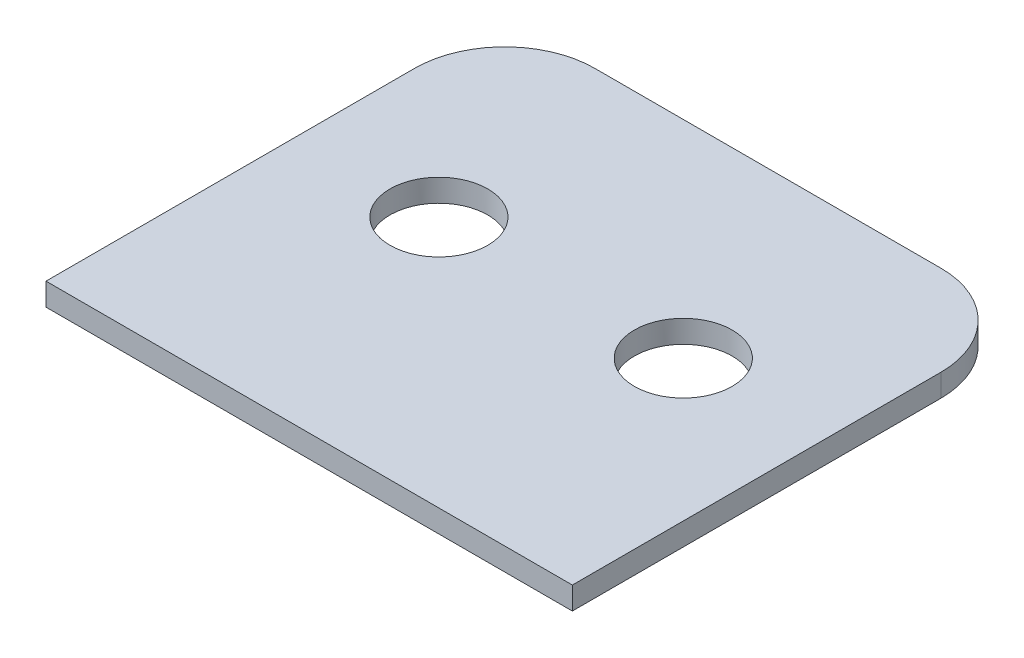
ISO-10303-21;
HEADER;
FILE_DESCRIPTION(('STEP AP214'),'2;1');
FILE_NAME('part.step','',(''),(''),'','','');
FILE_SCHEMA(('AUTOMOTIVE_DESIGN { 1 0 10303 214 1 1 1 1 }'));
ENDSEC;
DATA;
#1=APPLICATION_CONTEXT('core data for automotive mechanical design processes');
#2=APPLICATION_PROTOCOL_DEFINITION('international standard','automotive_design',2000,#1);
#3=PRODUCT_CONTEXT('',#1,'mechanical');
#4=PRODUCT('Part','Part','',(#3));
#5=PRODUCT_RELATED_PRODUCT_CATEGORY('part','',(#4));
#6=PRODUCT_DEFINITION_FORMATION('','',#4);
#7=PRODUCT_DEFINITION_CONTEXT('part definition',#1,'design');
#8=PRODUCT_DEFINITION('design','',#6,#7);
#9=PRODUCT_DEFINITION_SHAPE('','',#8);
#10=(LENGTH_UNIT() NAMED_UNIT(*) SI_UNIT(.MILLI.,.METRE.));
#11=(NAMED_UNIT(*) PLANE_ANGLE_UNIT() SI_UNIT($,.RADIAN.));
#12=(NAMED_UNIT(*) SI_UNIT($,.STERADIAN.) SOLID_ANGLE_UNIT());
#13=UNCERTAINTY_MEASURE_WITH_UNIT(LENGTH_MEASURE(1.E-05),#10,'distance_accuracy_value','');
#14=(GEOMETRIC_REPRESENTATION_CONTEXT(3) GLOBAL_UNCERTAINTY_ASSIGNED_CONTEXT((#13)) GLOBAL_UNIT_ASSIGNED_CONTEXT((#10,
#11,#12)) REPRESENTATION_CONTEXT('',''));
#15=CARTESIAN_POINT('',(0.,0.,0.));
#16=DIRECTION('',(0.,0.,1.));
#17=DIRECTION('',(1.,0.,0.));
#18=AXIS2_PLACEMENT_3D('',#15,#16,#17);
#19=CARTESIAN_POINT('',(35.,3.,33.5));
#20=DIRECTION('',(-1.,0.,0.));
#21=DIRECTION('',(0.,0.,1.));
#22=AXIS2_PLACEMENT_3D('',#19,#20,#21);
#23=PLANE('',#22);
#24=DIRECTION('',(0.,0.,-1.));
#25=VECTOR('',#24,1.);
#26=CARTESIAN_POINT('',(35.,0.,33.5));
#27=LINE('',#26,#25);
#28=CARTESIAN_POINT('',(35.,0.,33.5));
#29=VERTEX_POINT('',#28);
#30=CARTESIAN_POINT('',(35.,0.,-15.5));
#31=VERTEX_POINT('',#30);
#32=EDGE_CURVE('E112',#29,#31,#27,.T.);
#33=ORIENTED_EDGE('',*,*,#32,.T.);
#34=DIRECTION('',(0.,1.,0.));
#35=VECTOR('',#34,1.);
#36=CARTESIAN_POINT('',(35.,3.,-15.5));
#37=LINE('',#36,#35);
#38=CARTESIAN_POINT('',(35.,3.,-15.5));
#39=VERTEX_POINT('',#38);
#40=EDGE_CURVE('E102',#31,#39,#37,.T.);
#41=ORIENTED_EDGE('',*,*,#40,.T.);
#42=DIRECTION('',(0.,0.,-1.));
#43=VECTOR('',#42,1.);
#44=CARTESIAN_POINT('',(35.,3.,33.5));
#45=LINE('',#44,#43);
#46=CARTESIAN_POINT('',(35.,3.,33.5));
#47=VERTEX_POINT('',#46);
#48=EDGE_CURVE('E94',#47,#39,#45,.T.);
#49=ORIENTED_EDGE('',*,*,#48,.F.);
#50=DIRECTION('',(0.,-1.,0.));
#51=VECTOR('',#50,1.);
#52=CARTESIAN_POINT('',(35.,3.,33.5));
#53=LINE('',#52,#51);
#54=EDGE_CURVE('E103',#47,#29,#53,.T.);
#55=ORIENTED_EDGE('',*,*,#54,.T.);
#56=EDGE_LOOP('',(#33,#41,#49,#55));
#57=FACE_BOUND('',#56,.T.);
#58=ADVANCED_FACE('F33',(#57),#23,.F.);
#59=CARTESIAN_POINT('',(-35.,3.,33.5));
#60=DIRECTION('',(1.,0.,0.));
#61=DIRECTION('',(0.,0.,-1.));
#62=AXIS2_PLACEMENT_3D('',#59,#60,#61);
#63=PLANE('',#62);
#64=DIRECTION('',(0.,0.,1.));
#65=VECTOR('',#64,1.);
#66=CARTESIAN_POINT('',(-35.,3.,33.5));
#67=LINE('',#66,#65);
#68=CARTESIAN_POINT('',(-35.,3.,-15.5));
#69=VERTEX_POINT('',#68);
#70=CARTESIAN_POINT('',(-35.,3.,33.5));
#71=VERTEX_POINT('',#70);
#72=EDGE_CURVE('E85',#69,#71,#67,.T.);
#73=ORIENTED_EDGE('',*,*,#72,.F.);
#74=DIRECTION('',(0.,1.,0.));
#75=VECTOR('',#74,1.);
#76=CARTESIAN_POINT('',(-35.,3.,-15.5));
#77=LINE('',#76,#75);
#78=CARTESIAN_POINT('',(-35.,0.,-15.5));
#79=VERTEX_POINT('',#78);
#80=EDGE_CURVE('E11',#69,#79,#77,.F.);
#81=ORIENTED_EDGE('',*,*,#80,.T.);
#82=DIRECTION('',(0.,0.,1.));
#83=VECTOR('',#82,1.);
#84=CARTESIAN_POINT('',(-35.,0.,33.5));
#85=LINE('',#84,#83);
#86=CARTESIAN_POINT('',(-35.,0.,33.5));
#87=VERTEX_POINT('',#86);
#88=EDGE_CURVE('E99',#79,#87,#85,.T.);
#89=ORIENTED_EDGE('',*,*,#88,.T.);
#90=DIRECTION('',(0.,-1.,0.));
#91=VECTOR('',#90,1.);
#92=CARTESIAN_POINT('',(-35.,3.,33.5));
#93=LINE('',#92,#91);
#94=EDGE_CURVE('E97',#71,#87,#93,.T.);
#95=ORIENTED_EDGE('',*,*,#94,.F.);
#96=EDGE_LOOP('',(#73,#81,#89,#95));
#97=FACE_BOUND('',#96,.T.);
#98=ADVANCED_FACE('F98',(#97),#63,.F.);
#99=CARTESIAN_POINT('',(-35.,3.,33.5));
#100=DIRECTION('',(0.,0.,-1.));
#101=DIRECTION('',(-1.,0.,0.));
#102=AXIS2_PLACEMENT_3D('',#99,#100,#101);
#103=PLANE('',#102);
#104=DIRECTION('',(1.,0.,0.));
#105=VECTOR('',#104,1.);
#106=CARTESIAN_POINT('',(-35.,0.,33.5));
#107=LINE('',#106,#105);
#108=EDGE_CURVE('E117',#87,#29,#107,.T.);
#109=ORIENTED_EDGE('',*,*,#108,.T.);
#110=ORIENTED_EDGE('',*,*,#54,.F.);
#111=DIRECTION('',(1.,0.,0.));
#112=VECTOR('',#111,1.);
#113=CARTESIAN_POINT('',(-35.,3.,33.5));
#114=LINE('',#113,#112);
#115=EDGE_CURVE('E90',#71,#47,#114,.T.);
#116=ORIENTED_EDGE('',*,*,#115,.F.);
#117=ORIENTED_EDGE('',*,*,#94,.T.);
#118=EDGE_LOOP('',(#109,#110,#116,#117));
#119=FACE_BOUND('',#118,.T.);
#120=ADVANCED_FACE('F105',(#119),#103,.F.);
#121=CARTESIAN_POINT('',(0.,3.,0.));
#122=DIRECTION('',(0.,-1.,0.));
#123=DIRECTION('',(0.,0.,-1.));
#124=AXIS2_PLACEMENT_3D('',#121,#122,#123);
#125=PLANE('',#124);
#126=CARTESIAN_POINT('',(16.25,3.,0.));
#127=DIRECTION('',(0.,-1.,0.));
#128=DIRECTION('',(0.,0.,-1.));
#129=AXIS2_PLACEMENT_3D('',#126,#127,#128);
#130=CIRCLE('',#129,6.5);
#131=CARTESIAN_POINT('',(16.25,3.,-6.5));
#132=VERTEX_POINT('',#131);
#133=EDGE_CURVE('E149',#132,#132,#130,.F.);
#134=ORIENTED_EDGE('',*,*,#133,.F.);
#135=EDGE_LOOP('',(#134));
#136=FACE_BOUND('',#135,.T.);
#137=CARTESIAN_POINT('',(-16.25,3.,0.));
#138=DIRECTION('',(0.,-1.,0.));
#139=DIRECTION('',(0.,0.,-1.));
#140=AXIS2_PLACEMENT_3D('',#137,#138,#139);
#141=CIRCLE('',#140,6.5);
#142=CARTESIAN_POINT('',(-16.25,3.,-6.5));
#143=VERTEX_POINT('',#142);
#144=EDGE_CURVE('E141',#143,#143,#141,.T.);
#145=ORIENTED_EDGE('',*,*,#144,.T.);
#146=EDGE_LOOP('',(#145));
#147=FACE_BOUND('',#146,.T.);
#148=ORIENTED_EDGE('',*,*,#48,.T.);
#149=CARTESIAN_POINT('',(23.,3.,-15.5));
#150=DIRECTION('',(0.,-1.,0.));
#151=DIRECTION('',(0.,0.,-1.));
#152=AXIS2_PLACEMENT_3D('',#149,#150,#151);
#153=CIRCLE('',#152,12.);
#154=CARTESIAN_POINT('',(23.,3.,-27.5));
#155=VERTEX_POINT('',#154);
#156=EDGE_CURVE('E122',#39,#155,#153,.F.);
#157=ORIENTED_EDGE('',*,*,#156,.T.);
#158=DIRECTION('',(-1.,0.,0.));
#159=VECTOR('',#158,1.);
#160=CARTESIAN_POINT('',(0.,3.,-27.5));
#161=LINE('',#160,#159);
#162=CARTESIAN_POINT('',(-23.,3.,-27.5));
#163=VERTEX_POINT('',#162);
#164=EDGE_CURVE('E115',#155,#163,#161,.T.);
#165=ORIENTED_EDGE('',*,*,#164,.T.);
#166=CARTESIAN_POINT('',(-23.,3.,-15.5));
#167=DIRECTION('',(0.,-1.,0.));
#168=DIRECTION('',(0.,0.,-1.));
#169=AXIS2_PLACEMENT_3D('',#166,#167,#168);
#170=CIRCLE('',#169,12.);
#171=EDGE_CURVE('E93',#163,#69,#170,.F.);
#172=ORIENTED_EDGE('',*,*,#171,.T.);
#173=ORIENTED_EDGE('',*,*,#72,.T.);
#174=ORIENTED_EDGE('',*,*,#115,.T.);
#175=EDGE_LOOP('',(#148,#157,#165,#172,#173,#174));
#176=FACE_BOUND('',#175,.T.);
#177=ADVANCED_FACE('F88',(#136,#147,#176),#125,.F.);
#178=CARTESIAN_POINT('',(0.,0.,0.));
#179=DIRECTION('',(0.,-1.,0.));
#180=DIRECTION('',(0.,0.,-1.));
#181=AXIS2_PLACEMENT_3D('',#178,#179,#180);
#182=PLANE('',#181);
#183=CARTESIAN_POINT('',(16.25,0.,0.));
#184=DIRECTION('',(0.,-1.,0.));
#185=DIRECTION('',(0.,0.,1.));
#186=AXIS2_PLACEMENT_3D('',#183,#184,#185);
#187=CIRCLE('',#186,6.5);
#188=CARTESIAN_POINT('',(16.25,0.,6.5));
#189=VERTEX_POINT('',#188);
#190=EDGE_CURVE('E152',#189,#189,#187,.T.);
#191=ORIENTED_EDGE('',*,*,#190,.F.);
#192=EDGE_LOOP('',(#191));
#193=FACE_BOUND('',#192,.T.);
#194=CARTESIAN_POINT('',(-16.25,0.,0.));
#195=DIRECTION('',(0.,1.,0.));
#196=DIRECTION('',(0.,0.,1.));
#197=AXIS2_PLACEMENT_3D('',#194,#195,#196);
#198=CIRCLE('',#197,6.5);
#199=CARTESIAN_POINT('',(-16.25,0.,6.5));
#200=VERTEX_POINT('',#199);
#201=EDGE_CURVE('E146',#200,#200,#198,.T.);
#202=ORIENTED_EDGE('',*,*,#201,.T.);
#203=EDGE_LOOP('',(#202));
#204=FACE_BOUND('',#203,.T.);
#205=DIRECTION('',(1.,0.,0.));
#206=VECTOR('',#205,1.);
#207=CARTESIAN_POINT('',(-35.,0.,-27.5));
#208=LINE('',#207,#206);
#209=CARTESIAN_POINT('',(-23.,0.,-27.5));
#210=VERTEX_POINT('',#209);
#211=CARTESIAN_POINT('',(23.,0.,-27.5));
#212=VERTEX_POINT('',#211);
#213=EDGE_CURVE('E133',#210,#212,#208,.T.);
#214=ORIENTED_EDGE('',*,*,#213,.T.);
#215=CARTESIAN_POINT('',(23.,0.,-15.5));
#216=DIRECTION('',(0.,-1.,0.));
#217=DIRECTION('',(0.,0.,-1.));
#218=AXIS2_PLACEMENT_3D('',#215,#216,#217);
#219=CIRCLE('',#218,12.);
#220=EDGE_CURVE('E41',#212,#31,#219,.T.);
#221=ORIENTED_EDGE('',*,*,#220,.T.);
#222=ORIENTED_EDGE('',*,*,#32,.F.);
#223=ORIENTED_EDGE('',*,*,#108,.F.);
#224=ORIENTED_EDGE('',*,*,#88,.F.);
#225=CARTESIAN_POINT('',(-23.,0.,-15.5));
#226=DIRECTION('',(0.,-1.,0.));
#227=DIRECTION('',(0.,0.,-1.));
#228=AXIS2_PLACEMENT_3D('',#225,#226,#227);
#229=CIRCLE('',#228,12.);
#230=EDGE_CURVE('E128',#79,#210,#229,.T.);
#231=ORIENTED_EDGE('',*,*,#230,.T.);
#232=EDGE_LOOP('',(#214,#221,#222,#223,#224,#231));
#233=FACE_BOUND('',#232,.T.);
#234=ADVANCED_FACE('F132',(#193,#204,#233),#182,.T.);
#235=CARTESIAN_POINT('',(-35.,0.,-27.5));
#236=DIRECTION('',(0.,0.,1.));
#237=DIRECTION('',(1.,0.,0.));
#238=AXIS2_PLACEMENT_3D('',#235,#236,#237);
#239=PLANE('',#238);
#240=ORIENTED_EDGE('',*,*,#164,.F.);
#241=DIRECTION('',(0.,1.,0.));
#242=VECTOR('',#241,1.);
#243=CARTESIAN_POINT('',(23.,0.,-27.5));
#244=LINE('',#243,#242);
#245=EDGE_CURVE('E54',#155,#212,#244,.F.);
#246=ORIENTED_EDGE('',*,*,#245,.T.);
#247=ORIENTED_EDGE('',*,*,#213,.F.);
#248=DIRECTION('',(0.,1.,0.));
#249=VECTOR('',#248,1.);
#250=CARTESIAN_POINT('',(-23.,0.,-27.5));
#251=LINE('',#250,#249);
#252=EDGE_CURVE('E124',#210,#163,#251,.T.);
#253=ORIENTED_EDGE('',*,*,#252,.T.);
#254=EDGE_LOOP('',(#240,#246,#247,#253));
#255=FACE_BOUND('',#254,.T.);
#256=ADVANCED_FACE('F138',(#255),#239,.F.);
#257=CARTESIAN_POINT('',(23.,3.,-15.5));
#258=DIRECTION('',(0.,1.,0.));
#259=DIRECTION('',(0.,0.,1.));
#260=AXIS2_PLACEMENT_3D('',#257,#258,#259);
#261=CYLINDRICAL_SURFACE('',#260,12.);
#262=ORIENTED_EDGE('',*,*,#220,.F.);
#263=ORIENTED_EDGE('',*,*,#245,.F.);
#264=ORIENTED_EDGE('',*,*,#156,.F.);
#265=ORIENTED_EDGE('',*,*,#40,.F.);
#266=EDGE_LOOP('',(#262,#263,#264,#265));
#267=FACE_BOUND('',#266,.T.);
#268=ADVANCED_FACE('F137',(#267),#261,.T.);
#269=CARTESIAN_POINT('',(-23.,0.,-15.5));
#270=DIRECTION('',(0.,1.,0.));
#271=DIRECTION('',(0.,0.,1.));
#272=AXIS2_PLACEMENT_3D('',#269,#270,#271);
#273=CYLINDRICAL_SURFACE('',#272,12.);
#274=ORIENTED_EDGE('',*,*,#230,.F.);
#275=ORIENTED_EDGE('',*,*,#80,.F.);
#276=ORIENTED_EDGE('',*,*,#171,.F.);
#277=ORIENTED_EDGE('',*,*,#252,.F.);
#278=EDGE_LOOP('',(#274,#275,#276,#277));
#279=FACE_BOUND('',#278,.T.);
#280=ADVANCED_FACE('F35',(#279),#273,.T.);
#281=CARTESIAN_POINT('',(-16.25,0.,0.));
#282=DIRECTION('',(0.,1.,0.));
#283=DIRECTION('',(0.,0.,1.));
#284=AXIS2_PLACEMENT_3D('',#281,#282,#283);
#285=CYLINDRICAL_SURFACE('',#284,6.5);
#286=ORIENTED_EDGE('',*,*,#201,.F.);
#287=EDGE_LOOP('',(#286));
#288=FACE_BOUND('',#287,.T.);
#289=ORIENTED_EDGE('',*,*,#144,.F.);
#290=EDGE_LOOP('',(#289));
#291=FACE_BOUND('',#290,.T.);
#292=ADVANCED_FACE('F164',(#288,#291),#285,.F.);
#293=CARTESIAN_POINT('',(16.25,0.,0.));
#294=DIRECTION('',(0.,1.,0.));
#295=DIRECTION('',(0.,0.,1.));
#296=AXIS2_PLACEMENT_3D('',#293,#294,#295);
#297=CYLINDRICAL_SURFACE('',#296,6.5);
#298=ORIENTED_EDGE('',*,*,#190,.T.);
#299=EDGE_LOOP('',(#298));
#300=FACE_BOUND('',#299,.T.);
#301=ORIENTED_EDGE('',*,*,#133,.T.);
#302=EDGE_LOOP('',(#301));
#303=FACE_BOUND('',#302,.T.);
#304=ADVANCED_FACE('F156',(#300,#303),#297,.F.);
#305=CLOSED_SHELL('',(#58,#98,#120,#177,#234,#256,#268,#280,#292,#304));
#306=MANIFOLD_SOLID_BREP('B2',#305);
#307=ADVANCED_BREP_SHAPE_REPRESENTATION('',(#18,#306),#14);
#308=SHAPE_DEFINITION_REPRESENTATION(#9,#307);
ENDSEC;
END-ISO-10303-21;
